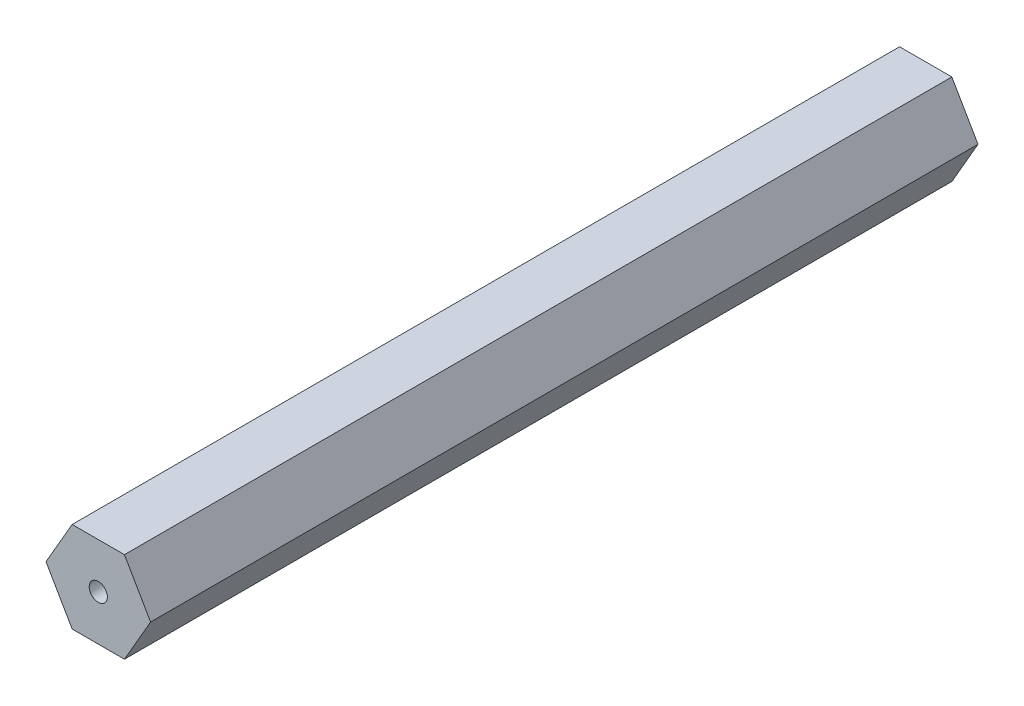
ISO-10303-21;
HEADER;
FILE_DESCRIPTION(('STEP AP214'),'2;1');
FILE_NAME('part.step','',(''),(''),'','','');
FILE_SCHEMA(('AUTOMOTIVE_DESIGN { 1 0 10303 214 1 1 1 1 }'));
ENDSEC;
DATA;
#1=APPLICATION_CONTEXT('core data for automotive mechanical design processes');
#2=APPLICATION_PROTOCOL_DEFINITION('international standard','automotive_design',2000,#1);
#3=PRODUCT_CONTEXT('',#1,'mechanical');
#4=PRODUCT('Part','Part','',(#3));
#5=PRODUCT_RELATED_PRODUCT_CATEGORY('part','',(#4));
#6=PRODUCT_DEFINITION_FORMATION('','',#4);
#7=PRODUCT_DEFINITION_CONTEXT('part definition',#1,'design');
#8=PRODUCT_DEFINITION('design','',#6,#7);
#9=PRODUCT_DEFINITION_SHAPE('','',#8);
#10=(LENGTH_UNIT() NAMED_UNIT(*) SI_UNIT(.MILLI.,.METRE.));
#11=(NAMED_UNIT(*) PLANE_ANGLE_UNIT() SI_UNIT($,.RADIAN.));
#12=(NAMED_UNIT(*) SI_UNIT($,.STERADIAN.) SOLID_ANGLE_UNIT());
#13=UNCERTAINTY_MEASURE_WITH_UNIT(LENGTH_MEASURE(1.E-05),#10,'distance_accuracy_value','');
#14=(GEOMETRIC_REPRESENTATION_CONTEXT(3) GLOBAL_UNCERTAINTY_ASSIGNED_CONTEXT((#13)) GLOBAL_UNIT_ASSIGNED_CONTEXT((#10,
#11,#12)) REPRESENTATION_CONTEXT('',''));
#15=CARTESIAN_POINT('',(0.,0.,0.));
#16=DIRECTION('',(0.,0.,1.));
#17=DIRECTION('',(1.,0.,0.));
#18=AXIS2_PLACEMENT_3D('',#15,#16,#17);
#19=CARTESIAN_POINT('',(0.,0.,116.0272));
#20=DIRECTION('',(0.,0.,1.));
#21=DIRECTION('',(1.,0.,0.));
#22=AXIS2_PLACEMENT_3D('',#19,#20,#21);
#23=PLANE('',#22);
#24=DIRECTION('',(0.499999999999995,0.866025403784442,0.));
#25=VECTOR('',#24,1.);
#26=CARTESIAN_POINT('',(3.66617420935418,-6.34999999999993,116.0272));
#27=LINE('',#26,#25);
#28=CARTESIAN_POINT('',(3.66617420935418,-6.34999999999993,116.0272));
#29=VERTEX_POINT('',#28);
#30=CARTESIAN_POINT('',(7.33234841870822,0.,116.0272));
#31=VERTEX_POINT('',#30);
#32=EDGE_CURVE('E131',#29,#31,#27,.T.);
#33=ORIENTED_EDGE('',*,*,#32,.T.);
#34=DIRECTION('',(-0.500000000000001,0.866025403784438,0.));
#35=VECTOR('',#34,1.);
#36=CARTESIAN_POINT('',(7.33234841870822,0.,116.0272));
#37=LINE('',#36,#35);
#38=CARTESIAN_POINT('',(3.66617420935409,6.34999999999998,116.0272));
#39=VERTEX_POINT('',#38);
#40=EDGE_CURVE('E89',#31,#39,#37,.T.);
#41=ORIENTED_EDGE('',*,*,#40,.T.);
#42=DIRECTION('',(-1.,0.,0.));
#43=VECTOR('',#42,1.);
#44=CARTESIAN_POINT('',(3.66617420935409,6.34999999999998,116.0272));
#45=LINE('',#44,#43);
#46=CARTESIAN_POINT('',(-3.66617420935414,6.34999999999996,116.0272));
#47=VERTEX_POINT('',#46);
#48=EDGE_CURVE('E102',#39,#47,#45,.T.);
#49=ORIENTED_EDGE('',*,*,#48,.T.);
#50=DIRECTION('',(-0.499999999999995,-0.866025403784441,0.));
#51=VECTOR('',#50,1.);
#52=CARTESIAN_POINT('',(-3.66617420935414,6.34999999999996,116.0272));
#53=LINE('',#52,#51);
#54=CARTESIAN_POINT('',(-7.33234841870822,0.,116.0272));
#55=VERTEX_POINT('',#54);
#56=EDGE_CURVE('E96',#47,#55,#53,.T.);
#57=ORIENTED_EDGE('',*,*,#56,.T.);
#58=DIRECTION('',(0.500000000000007,-0.866025403784434,0.));
#59=VECTOR('',#58,1.);
#60=CARTESIAN_POINT('',(-7.33234841870822,0.,116.0272));
#61=LINE('',#60,#59);
#62=CARTESIAN_POINT('',(-3.66617420935405,-6.35000000000001,116.0272));
#63=VERTEX_POINT('',#62);
#64=EDGE_CURVE('E100',#55,#63,#61,.T.);
#65=ORIENTED_EDGE('',*,*,#64,.T.);
#66=DIRECTION('',(1.,0.,0.));
#67=VECTOR('',#66,1.);
#68=CARTESIAN_POINT('',(-3.66617420935405,-6.35000000000001,116.0272));
#69=LINE('',#68,#67);
#70=EDGE_CURVE('E52',#63,#29,#69,.T.);
#71=ORIENTED_EDGE('',*,*,#70,.T.);
#72=EDGE_LOOP('',(#33,#41,#49,#57,#65,#71));
#73=FACE_BOUND('',#72,.T.);
#74=CARTESIAN_POINT('',(0.,0.,116.0272));
#75=DIRECTION('',(0.,0.,1.));
#76=DIRECTION('',(1.,0.,0.));
#77=AXIS2_PLACEMENT_3D('',#74,#75,#76);
#78=CIRCLE('',#77,1.27);
#79=CARTESIAN_POINT('',(1.27,0.,116.0272));
#80=VERTEX_POINT('',#79);
#81=EDGE_CURVE('E124',#80,#80,#78,.T.);
#82=ORIENTED_EDGE('',*,*,#81,.F.);
#83=EDGE_LOOP('',(#82));
#84=FACE_BOUND('',#83,.T.);
#85=ADVANCED_FACE('F35',(#73,#84),#23,.T.);
#86=CARTESIAN_POINT('',(0.,0.,0.));
#87=DIRECTION('',(0.,0.,1.));
#88=DIRECTION('',(1.,0.,0.));
#89=AXIS2_PLACEMENT_3D('',#86,#87,#88);
#90=PLANE('',#89);
#91=DIRECTION('',(0.499999999999995,0.866025403784442,0.));
#92=VECTOR('',#91,1.);
#93=CARTESIAN_POINT('',(3.66617420935418,-6.34999999999993,0.));
#94=LINE('',#93,#92);
#95=CARTESIAN_POINT('',(3.66617420935418,-6.34999999999993,0.));
#96=VERTEX_POINT('',#95);
#97=CARTESIAN_POINT('',(7.33234841870822,0.,0.));
#98=VERTEX_POINT('',#97);
#99=EDGE_CURVE('E120',#96,#98,#94,.T.);
#100=ORIENTED_EDGE('',*,*,#99,.F.);
#101=DIRECTION('',(1.,0.,0.));
#102=VECTOR('',#101,1.);
#103=CARTESIAN_POINT('',(-3.66617420935405,-6.35000000000001,0.));
#104=LINE('',#103,#102);
#105=CARTESIAN_POINT('',(-3.66617420935405,-6.35000000000001,0.));
#106=VERTEX_POINT('',#105);
#107=EDGE_CURVE('E81',#106,#96,#104,.T.);
#108=ORIENTED_EDGE('',*,*,#107,.F.);
#109=DIRECTION('',(0.500000000000007,-0.866025403784434,0.));
#110=VECTOR('',#109,1.);
#111=CARTESIAN_POINT('',(-7.33234841870822,0.,0.));
#112=LINE('',#111,#110);
#113=CARTESIAN_POINT('',(-7.33234841870822,0.,0.));
#114=VERTEX_POINT('',#113);
#115=EDGE_CURVE('E75',#114,#106,#112,.T.);
#116=ORIENTED_EDGE('',*,*,#115,.F.);
#117=DIRECTION('',(-0.499999999999995,-0.866025403784441,0.));
#118=VECTOR('',#117,1.);
#119=CARTESIAN_POINT('',(-3.66617420935414,6.34999999999996,0.));
#120=LINE('',#119,#118);
#121=CARTESIAN_POINT('',(-3.66617420935414,6.34999999999996,0.));
#122=VERTEX_POINT('',#121);
#123=EDGE_CURVE('E110',#122,#114,#120,.T.);
#124=ORIENTED_EDGE('',*,*,#123,.F.);
#125=DIRECTION('',(-1.,0.,0.));
#126=VECTOR('',#125,1.);
#127=CARTESIAN_POINT('',(3.66617420935409,6.34999999999998,0.));
#128=LINE('',#127,#126);
#129=CARTESIAN_POINT('',(3.66617420935409,6.34999999999998,0.));
#130=VERTEX_POINT('',#129);
#131=EDGE_CURVE('E126',#130,#122,#128,.T.);
#132=ORIENTED_EDGE('',*,*,#131,.F.);
#133=DIRECTION('',(-0.500000000000001,0.866025403784438,0.));
#134=VECTOR('',#133,1.);
#135=CARTESIAN_POINT('',(7.33234841870822,0.,0.));
#136=LINE('',#135,#134);
#137=EDGE_CURVE('E123',#98,#130,#136,.T.);
#138=ORIENTED_EDGE('',*,*,#137,.F.);
#139=EDGE_LOOP('',(#100,#108,#116,#124,#132,#138));
#140=FACE_BOUND('',#139,.T.);
#141=CARTESIAN_POINT('',(0.,0.,0.));
#142=DIRECTION('',(0.,0.,1.));
#143=DIRECTION('',(1.,0.,0.));
#144=AXIS2_PLACEMENT_3D('',#141,#142,#143);
#145=CIRCLE('',#144,1.27);
#146=CARTESIAN_POINT('',(1.27,0.,0.));
#147=VERTEX_POINT('',#146);
#148=EDGE_CURVE('E224',#147,#147,#145,.T.);
#149=ORIENTED_EDGE('',*,*,#148,.T.);
#150=EDGE_LOOP('',(#149));
#151=FACE_BOUND('',#150,.T.);
#152=ADVANCED_FACE('F140',(#140,#151),#90,.F.);
#153=CARTESIAN_POINT('',(3.66617420935418,-6.34999999999993,116.0272));
#154=DIRECTION('',(-0.866025403784441,0.499999999999995,0.));
#155=DIRECTION('',(-0.499999999999995,-0.866025403784442,0.));
#156=AXIS2_PLACEMENT_3D('',#153,#154,#155);
#157=PLANE('',#156);
#158=ORIENTED_EDGE('',*,*,#99,.T.);
#159=DIRECTION('',(0.,0.,-1.));
#160=VECTOR('',#159,1.);
#161=CARTESIAN_POINT('',(7.33234841870822,0.,116.0272));
#162=LINE('',#161,#160);
#163=EDGE_CURVE('E11',#31,#98,#162,.T.);
#164=ORIENTED_EDGE('',*,*,#163,.F.);
#165=ORIENTED_EDGE('',*,*,#32,.F.);
#166=DIRECTION('',(0.,0.,-1.));
#167=VECTOR('',#166,1.);
#168=CARTESIAN_POINT('',(3.66617420935418,-6.34999999999993,116.0272));
#169=LINE('',#168,#167);
#170=EDGE_CURVE('E116',#29,#96,#169,.T.);
#171=ORIENTED_EDGE('',*,*,#170,.T.);
#172=EDGE_LOOP('',(#158,#164,#165,#171));
#173=FACE_BOUND('',#172,.T.);
#174=ADVANCED_FACE('F37',(#173),#157,.F.);
#175=CARTESIAN_POINT('',(7.33234841870822,0.,116.0272));
#176=DIRECTION('',(-0.866025403784438,-0.500000000000001,0.));
#177=DIRECTION('',(0.500000000000001,-0.866025403784438,0.));
#178=AXIS2_PLACEMENT_3D('',#175,#176,#177);
#179=PLANE('',#178);
#180=ORIENTED_EDGE('',*,*,#137,.T.);
#181=DIRECTION('',(0.,0.,-1.));
#182=VECTOR('',#181,1.);
#183=CARTESIAN_POINT('',(3.66617420935409,6.34999999999998,116.0272));
#184=LINE('',#183,#182);
#185=EDGE_CURVE('E44',#39,#130,#184,.T.);
#186=ORIENTED_EDGE('',*,*,#185,.F.);
#187=ORIENTED_EDGE('',*,*,#40,.F.);
#188=ORIENTED_EDGE('',*,*,#163,.T.);
#189=EDGE_LOOP('',(#180,#186,#187,#188));
#190=FACE_BOUND('',#189,.T.);
#191=ADVANCED_FACE('F165',(#190),#179,.F.);
#192=CARTESIAN_POINT('',(3.66617420935409,6.34999999999998,116.0272));
#193=DIRECTION('',(0.,-1.,0.));
#194=DIRECTION('',(1.,0.,0.));
#195=AXIS2_PLACEMENT_3D('',#192,#193,#194);
#196=PLANE('',#195);
#197=ORIENTED_EDGE('',*,*,#131,.T.);
#198=DIRECTION('',(0.,0.,-1.));
#199=VECTOR('',#198,1.);
#200=CARTESIAN_POINT('',(-3.66617420935414,6.34999999999996,116.0272));
#201=LINE('',#200,#199);
#202=EDGE_CURVE('E111',#47,#122,#201,.T.);
#203=ORIENTED_EDGE('',*,*,#202,.F.);
#204=ORIENTED_EDGE('',*,*,#48,.F.);
#205=ORIENTED_EDGE('',*,*,#185,.T.);
#206=EDGE_LOOP('',(#197,#203,#204,#205));
#207=FACE_BOUND('',#206,.T.);
#208=ADVANCED_FACE('F137',(#207),#196,.F.);
#209=CARTESIAN_POINT('',(-3.66617420935414,6.34999999999996,116.0272));
#210=DIRECTION('',(0.866025403784441,-0.499999999999995,0.));
#211=DIRECTION('',(0.499999999999995,0.866025403784441,0.));
#212=AXIS2_PLACEMENT_3D('',#209,#210,#211);
#213=PLANE('',#212);
#214=ORIENTED_EDGE('',*,*,#123,.T.);
#215=DIRECTION('',(0.,0.,-1.));
#216=VECTOR('',#215,1.);
#217=CARTESIAN_POINT('',(-7.33234841870822,0.,116.0272));
#218=LINE('',#217,#216);
#219=EDGE_CURVE('E107',#55,#114,#218,.T.);
#220=ORIENTED_EDGE('',*,*,#219,.F.);
#221=ORIENTED_EDGE('',*,*,#56,.F.);
#222=ORIENTED_EDGE('',*,*,#202,.T.);
#223=EDGE_LOOP('',(#214,#220,#221,#222));
#224=FACE_BOUND('',#223,.T.);
#225=ADVANCED_FACE('F108',(#224),#213,.F.);
#226=CARTESIAN_POINT('',(-7.33234841870822,0.,116.0272));
#227=DIRECTION('',(0.866025403784435,0.500000000000007,0.));
#228=DIRECTION('',(-0.500000000000007,0.866025403784435,0.));
#229=AXIS2_PLACEMENT_3D('',#226,#227,#228);
#230=PLANE('',#229);
#231=ORIENTED_EDGE('',*,*,#115,.T.);
#232=DIRECTION('',(0.,0.,-1.));
#233=VECTOR('',#232,1.);
#234=CARTESIAN_POINT('',(-3.66617420935405,-6.35000000000001,116.0272));
#235=LINE('',#234,#233);
#236=EDGE_CURVE('E112',#63,#106,#235,.T.);
#237=ORIENTED_EDGE('',*,*,#236,.F.);
#238=ORIENTED_EDGE('',*,*,#64,.F.);
#239=ORIENTED_EDGE('',*,*,#219,.T.);
#240=EDGE_LOOP('',(#231,#237,#238,#239));
#241=FACE_BOUND('',#240,.T.);
#242=ADVANCED_FACE('F114',(#241),#230,.F.);
#243=CARTESIAN_POINT('',(-3.66617420935405,-6.35000000000001,116.0272));
#244=DIRECTION('',(0.,1.,0.));
#245=DIRECTION('',(-1.,0.,0.));
#246=AXIS2_PLACEMENT_3D('',#243,#244,#245);
#247=PLANE('',#246);
#248=ORIENTED_EDGE('',*,*,#107,.T.);
#249=ORIENTED_EDGE('',*,*,#170,.F.);
#250=ORIENTED_EDGE('',*,*,#70,.F.);
#251=ORIENTED_EDGE('',*,*,#236,.T.);
#252=EDGE_LOOP('',(#248,#249,#250,#251));
#253=FACE_BOUND('',#252,.T.);
#254=ADVANCED_FACE('F145',(#253),#247,.F.);
#255=CARTESIAN_POINT('',(0.,0.,116.0272));
#256=DIRECTION('',(0.,0.,-1.));
#257=DIRECTION('',(-1.,0.,0.));
#258=AXIS2_PLACEMENT_3D('',#255,#256,#257);
#259=CYLINDRICAL_SURFACE('',#258,1.27);
#260=ORIENTED_EDGE('',*,*,#81,.T.);
#261=EDGE_LOOP('',(#260));
#262=FACE_BOUND('',#261,.T.);
#263=ORIENTED_EDGE('',*,*,#148,.F.);
#264=EDGE_LOOP('',(#263));
#265=FACE_BOUND('',#264,.T.);
#266=ADVANCED_FACE('F147',(#262,#265),#259,.F.);
#267=CLOSED_SHELL('',(#85,#152,#174,#191,#208,#225,#242,#254,#266));
#268=MANIFOLD_SOLID_BREP('B2',#267);
#269=ADVANCED_BREP_SHAPE_REPRESENTATION('',(#18,#268),#14);
#270=SHAPE_DEFINITION_REPRESENTATION(#9,#269);
ENDSEC;
END-ISO-10303-21;
